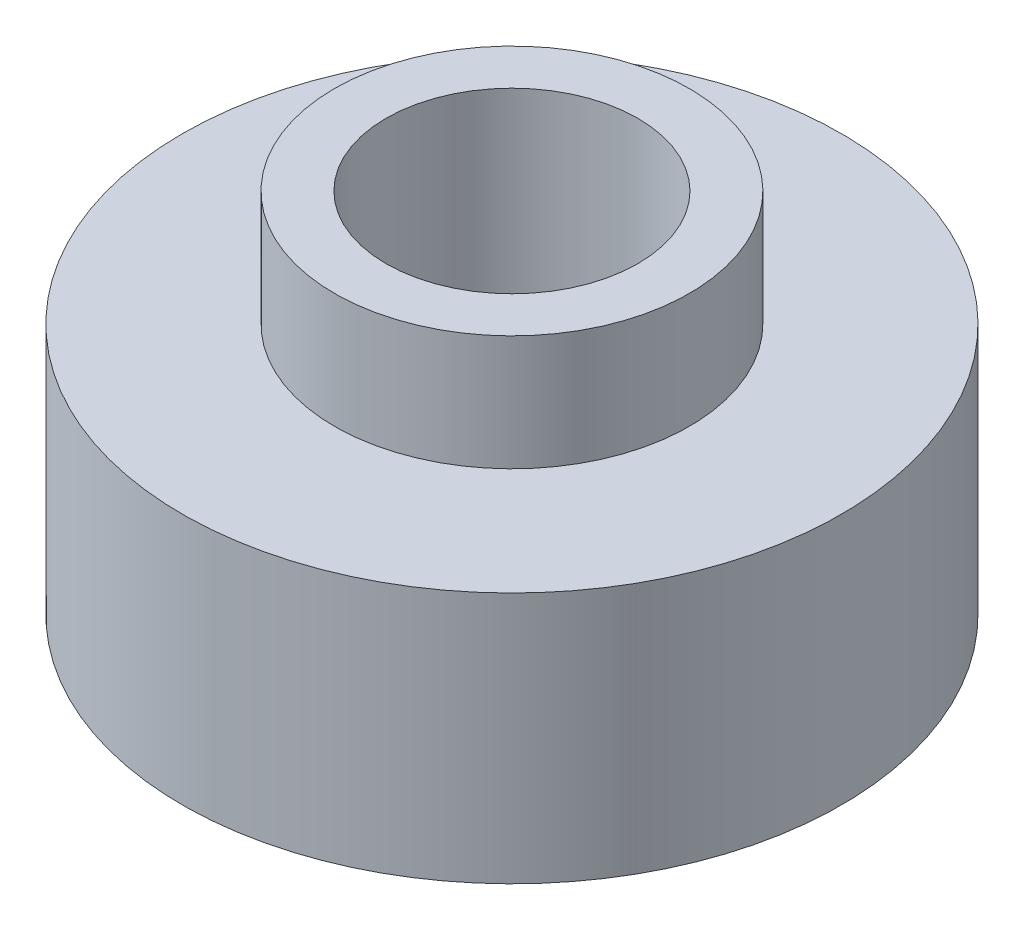
ISO-10303-21;
HEADER;
FILE_DESCRIPTION(('STEP AP214'),'2;1');
FILE_NAME('part.step','',(''),(''),'','','');
FILE_SCHEMA(('AUTOMOTIVE_DESIGN { 1 0 10303 214 1 1 1 1 }'));
ENDSEC;
DATA;
#1=APPLICATION_CONTEXT('core data for automotive mechanical design processes');
#2=APPLICATION_PROTOCOL_DEFINITION('international standard','automotive_design',2000,#1);
#3=PRODUCT_CONTEXT('',#1,'mechanical');
#4=PRODUCT('Part','Part','',(#3));
#5=PRODUCT_RELATED_PRODUCT_CATEGORY('part','',(#4));
#6=PRODUCT_DEFINITION_FORMATION('','',#4);
#7=PRODUCT_DEFINITION_CONTEXT('part definition',#1,'design');
#8=PRODUCT_DEFINITION('design','',#6,#7);
#9=PRODUCT_DEFINITION_SHAPE('','',#8);
#10=(LENGTH_UNIT() NAMED_UNIT(*) SI_UNIT(.MILLI.,.METRE.));
#11=(NAMED_UNIT(*) PLANE_ANGLE_UNIT() SI_UNIT($,.RADIAN.));
#12=(NAMED_UNIT(*) SI_UNIT($,.STERADIAN.) SOLID_ANGLE_UNIT());
#13=UNCERTAINTY_MEASURE_WITH_UNIT(LENGTH_MEASURE(1.E-05),#10,'distance_accuracy_value','');
#14=(GEOMETRIC_REPRESENTATION_CONTEXT(3) GLOBAL_UNCERTAINTY_ASSIGNED_CONTEXT((#13)) GLOBAL_UNIT_ASSIGNED_CONTEXT((#10,
#11,#12)) REPRESENTATION_CONTEXT('',''));
#15=CARTESIAN_POINT('',(0.,0.,0.));
#16=DIRECTION('',(0.,0.,1.));
#17=DIRECTION('',(1.,0.,0.));
#18=AXIS2_PLACEMENT_3D('',#15,#16,#17);
#19=CARTESIAN_POINT('',(0.,0.,0.));
#20=DIRECTION('',(0.,-1.,0.));
#21=DIRECTION('',(0.,0.,-1.));
#22=AXIS2_PLACEMENT_3D('',#19,#20,#21);
#23=CYLINDRICAL_SURFACE('',#22,3.50000000000007);
#24=CARTESIAN_POINT('',(0.,0.,0.));
#25=DIRECTION('',(0.,-1.,0.));
#26=DIRECTION('',(0.,0.,-1.));
#27=AXIS2_PLACEMENT_3D('',#24,#25,#26);
#28=CIRCLE('',#27,3.50000000000007);
#29=CARTESIAN_POINT('',(0.,0.,-3.5000000000001));
#30=VERTEX_POINT('',#29);
#31=EDGE_CURVE('E10',#30,#30,#28,.T.);
#32=ORIENTED_EDGE('',*,*,#31,.T.);
#33=EDGE_LOOP('',(#32));
#34=FACE_BOUND('',#33,.T.);
#35=CARTESIAN_POINT('',(0.,10.200003799899,0.));
#36=DIRECTION('',(0.,-1.,0.));
#37=DIRECTION('',(0.,0.,-1.));
#38=AXIS2_PLACEMENT_3D('',#35,#36,#37);
#39=CIRCLE('',#38,3.50000000000007);
#40=CARTESIAN_POINT('',(0.,10.200003799899,-3.5000000000001));
#41=VERTEX_POINT('',#40);
#42=EDGE_CURVE('E30',#41,#41,#39,.T.);
#43=ORIENTED_EDGE('',*,*,#42,.F.);
#44=EDGE_LOOP('',(#43));
#45=FACE_BOUND('',#44,.T.);
#46=ADVANCED_FACE('F14',(#34,#45),#23,.F.);
#47=CARTESIAN_POINT('',(0.,-13.9636775496497,0.));
#48=DIRECTION('',(0.,1.,0.));
#49=DIRECTION('',(-1.,0.,0.));
#50=AXIS2_PLACEMENT_3D('',#47,#48,#49);
#51=CYLINDRICAL_SURFACE('',#50,4.93237459994922);
#52=CARTESIAN_POINT('',(0.,10.200003799899,0.));
#53=DIRECTION('',(0.,1.,0.));
#54=DIRECTION('',(-1.,0.,0.));
#55=AXIS2_PLACEMENT_3D('',#52,#53,#54);
#56=CIRCLE('',#55,4.93237459994922);
#57=CARTESIAN_POINT('',(-4.93237459994922,10.200003799899,0.));
#58=VERTEX_POINT('',#57);
#59=EDGE_CURVE('E32',#58,#58,#56,.T.);
#60=ORIENTED_EDGE('',*,*,#59,.F.);
#61=EDGE_LOOP('',(#60));
#62=FACE_BOUND('',#61,.T.);
#63=CARTESIAN_POINT('',(0.,7.0000046,0.));
#64=DIRECTION('',(0.,1.,0.));
#65=DIRECTION('',(-1.,0.,0.));
#66=AXIS2_PLACEMENT_3D('',#63,#64,#65);
#67=CIRCLE('',#66,4.93237459994922);
#68=CARTESIAN_POINT('',(-4.93237459994922,7.0000046,0.));
#69=VERTEX_POINT('',#68);
#70=EDGE_CURVE('E22',#69,#69,#67,.T.);
#71=ORIENTED_EDGE('',*,*,#70,.T.);
#72=EDGE_LOOP('',(#71));
#73=FACE_BOUND('',#72,.T.);
#74=ADVANCED_FACE('F46',(#62,#73),#51,.T.);
#75=CARTESIAN_POINT('',(0.,-13.9636775496497,0.));
#76=DIRECTION('',(0.,1.,0.));
#77=DIRECTION('',(-1.,0.,0.));
#78=AXIS2_PLACEMENT_3D('',#75,#76,#77);
#79=CYLINDRICAL_SURFACE('',#78,9.16012425704849);
#80=CARTESIAN_POINT('',(0.,7.0000046,0.));
#81=DIRECTION('',(0.,1.,0.));
#82=DIRECTION('',(-1.,0.,0.));
#83=AXIS2_PLACEMENT_3D('',#80,#81,#82);
#84=CIRCLE('',#83,9.16012425704848);
#85=CARTESIAN_POINT('',(-9.16012425704848,7.0000046,0.));
#86=VERTEX_POINT('',#85);
#87=EDGE_CURVE('E18',#86,#86,#84,.T.);
#88=ORIENTED_EDGE('',*,*,#87,.F.);
#89=EDGE_LOOP('',(#88));
#90=FACE_BOUND('',#89,.T.);
#91=CARTESIAN_POINT('',(0.,0.,0.));
#92=DIRECTION('',(0.,1.,0.));
#93=DIRECTION('',(-1.,0.,0.));
#94=AXIS2_PLACEMENT_3D('',#91,#92,#93);
#95=CIRCLE('',#94,9.16012425704849);
#96=CARTESIAN_POINT('',(-9.16012425704848,0.,0.));
#97=VERTEX_POINT('',#96);
#98=EDGE_CURVE('E27',#97,#97,#95,.T.);
#99=ORIENTED_EDGE('',*,*,#98,.T.);
#100=EDGE_LOOP('',(#99));
#101=FACE_BOUND('',#100,.T.);
#102=ADVANCED_FACE('F52',(#90,#101),#79,.T.);
#103=CARTESIAN_POINT('',(9.16012425704849,7.0000046,0.));
#104=DIRECTION('',(0.,-1.,0.));
#105=DIRECTION('',(1.,0.,0.));
#106=AXIS2_PLACEMENT_3D('',#103,#104,#105);
#107=PLANE('',#106);
#108=ORIENTED_EDGE('',*,*,#70,.F.);
#109=EDGE_LOOP('',(#108));
#110=FACE_BOUND('',#109,.T.);
#111=ORIENTED_EDGE('',*,*,#87,.T.);
#112=EDGE_LOOP('',(#111));
#113=FACE_BOUND('',#112,.T.);
#114=ADVANCED_FACE('F58',(#110,#113),#107,.F.);
#115=CARTESIAN_POINT('',(0.,0.,0.));
#116=DIRECTION('',(0.,1.,0.));
#117=DIRECTION('',(-1.,0.,0.));
#118=AXIS2_PLACEMENT_3D('',#115,#116,#117);
#119=PLANE('',#118);
#120=ORIENTED_EDGE('',*,*,#31,.F.);
#121=EDGE_LOOP('',(#120));
#122=FACE_BOUND('',#121,.T.);
#123=ORIENTED_EDGE('',*,*,#98,.F.);
#124=EDGE_LOOP('',(#123));
#125=FACE_BOUND('',#124,.T.);
#126=ADVANCED_FACE('F61',(#122,#125),#119,.F.);
#127=CARTESIAN_POINT('',(4.93237459994922,10.200003799899,0.));
#128=DIRECTION('',(0.,-1.,0.));
#129=DIRECTION('',(1.,0.,0.));
#130=AXIS2_PLACEMENT_3D('',#127,#128,#129);
#131=PLANE('',#130);
#132=ORIENTED_EDGE('',*,*,#42,.T.);
#133=EDGE_LOOP('',(#132));
#134=FACE_BOUND('',#133,.T.);
#135=ORIENTED_EDGE('',*,*,#59,.T.);
#136=EDGE_LOOP('',(#135));
#137=FACE_BOUND('',#136,.T.);
#138=ADVANCED_FACE('F16',(#134,#137),#131,.F.);
#139=CLOSED_SHELL('',(#46,#74,#102,#114,#126,#138));
#140=MANIFOLD_SOLID_BREP('B1',#139);
#141=ADVANCED_BREP_SHAPE_REPRESENTATION('',(#18,#140),#14);
#142=SHAPE_DEFINITION_REPRESENTATION(#9,#141);
ENDSEC;
END-ISO-10303-21;
